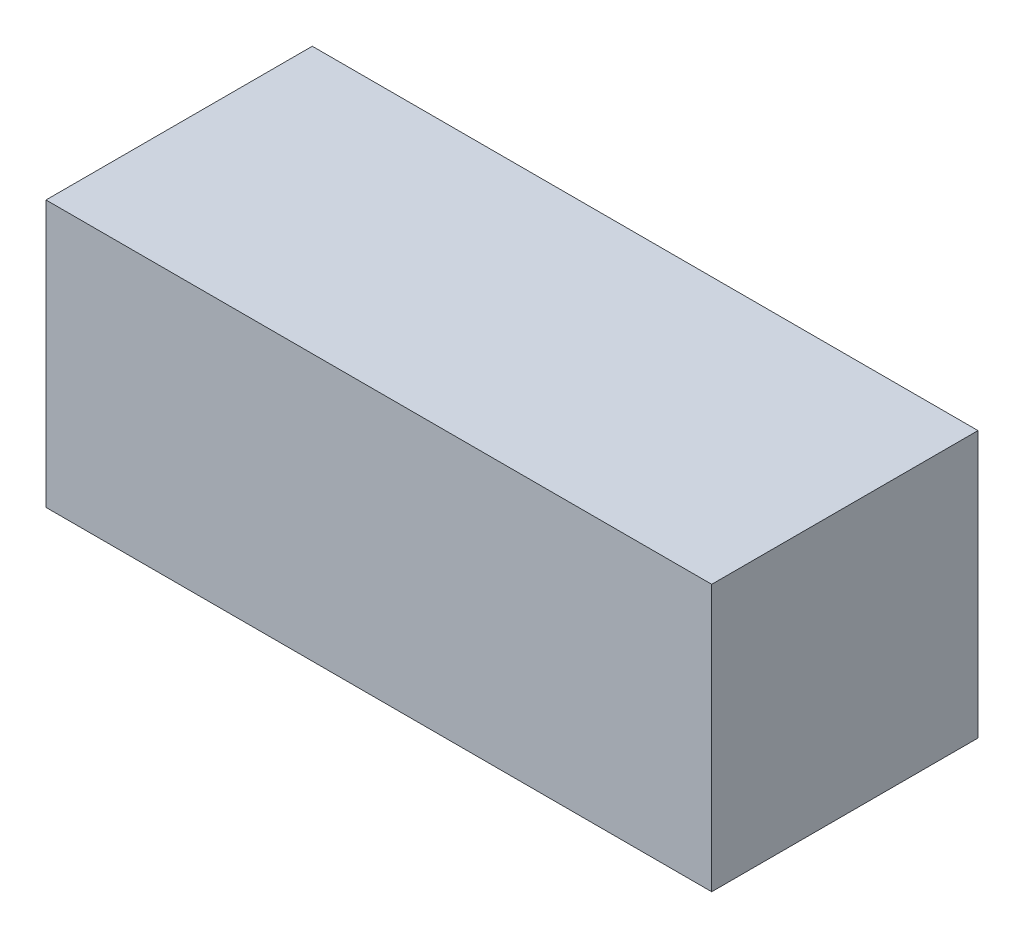
ISO-10303-21;
HEADER;
FILE_DESCRIPTION(('STEP AP214'),'2;1');
FILE_NAME('part.step','',(''),(''),'','','');
FILE_SCHEMA(('AUTOMOTIVE_DESIGN { 1 0 10303 214 1 1 1 1 }'));
ENDSEC;
DATA;
#1=APPLICATION_CONTEXT('core data for automotive mechanical design processes');
#2=APPLICATION_PROTOCOL_DEFINITION('international standard','automotive_design',2000,#1);
#3=PRODUCT_CONTEXT('',#1,'mechanical');
#4=PRODUCT('Part','Part','',(#3));
#5=PRODUCT_RELATED_PRODUCT_CATEGORY('part','',(#4));
#6=PRODUCT_DEFINITION_FORMATION('','',#4);
#7=PRODUCT_DEFINITION_CONTEXT('part definition',#1,'design');
#8=PRODUCT_DEFINITION('design','',#6,#7);
#9=PRODUCT_DEFINITION_SHAPE('','',#8);
#10=(LENGTH_UNIT() NAMED_UNIT(*) SI_UNIT(.MILLI.,.METRE.));
#11=(NAMED_UNIT(*) PLANE_ANGLE_UNIT() SI_UNIT($,.RADIAN.));
#12=(NAMED_UNIT(*) SI_UNIT($,.STERADIAN.) SOLID_ANGLE_UNIT());
#13=UNCERTAINTY_MEASURE_WITH_UNIT(LENGTH_MEASURE(1.E-05),#10,'distance_accuracy_value','');
#14=(GEOMETRIC_REPRESENTATION_CONTEXT(3) GLOBAL_UNCERTAINTY_ASSIGNED_CONTEXT((#13)) GLOBAL_UNIT_ASSIGNED_CONTEXT((#10,
#11,#12)) REPRESENTATION_CONTEXT('',''));
#15=CARTESIAN_POINT('',(0.,0.,0.));
#16=DIRECTION('',(0.,0.,1.));
#17=DIRECTION('',(1.,0.,0.));
#18=AXIS2_PLACEMENT_3D('',#15,#16,#17);
#19=CARTESIAN_POINT('',(-258.447090393941,705.,-341.76577979491));
#20=DIRECTION('',(0.,1.,0.));
#21=DIRECTION('',(0.,0.,-1.));
#22=AXIS2_PLACEMENT_3D('',#19,#20,#21);
#23=PLANE('',#22);
#24=CARTESIAN_POINT('',(-474.449169572246,705.,-382.793687092254));
#25=DIRECTION('',(0.,-1.,0.));
#26=DIRECTION('',(0.,0.,-1.));
#27=AXIS2_PLACEMENT_3D('',#24,#25,#26);
#28=CIRCLE('',#27,3.02232510648865);
#29=CARTESIAN_POINT('',(-474.449169572246,705.,-385.816012198742));
#30=VERTEX_POINT('',#29);
#31=EDGE_CURVE('E231',#30,#30,#28,.T.);
#32=ORIENTED_EDGE('',*,*,#31,.T.);
#33=EDGE_LOOP('',(#32));
#34=FACE_BOUND('',#33,.T.);
#35=CARTESIAN_POINT('',(-466.317801150332,705.,-375.92365410933));
#36=DIRECTION('',(0.,-1.,0.));
#37=DIRECTION('',(0.,0.,-1.));
#38=AXIS2_PLACEMENT_3D('',#35,#36,#37);
#39=CIRCLE('',#38,2.92635446588858);
#40=CARTESIAN_POINT('',(-466.317801150332,705.,-378.850008575219));
#41=VERTEX_POINT('',#40);
#42=EDGE_CURVE('E744',#41,#41,#39,.T.);
#43=ORIENTED_EDGE('',*,*,#42,.T.);
#44=EDGE_LOOP('',(#43));
#45=FACE_BOUND('',#44,.T.);
#46=CARTESIAN_POINT('',(-431.013382426237,705.,-332.77130718692));
#47=DIRECTION('',(0.,-1.,0.));
#48=DIRECTION('',(0.,0.,-1.));
#49=AXIS2_PLACEMENT_3D('',#46,#47,#48);
#50=CIRCLE('',#49,2.96969460121312);
#51=CARTESIAN_POINT('',(-431.013382426237,705.,-335.741001788134));
#52=VERTEX_POINT('',#51);
#53=EDGE_CURVE('E747',#52,#52,#50,.T.);
#54=ORIENTED_EDGE('',*,*,#53,.T.);
#55=EDGE_LOOP('',(#54));
#56=FACE_BOUND('',#55,.T.);
#57=CARTESIAN_POINT('',(-421.082774625095,705.,-327.80979347949));
#58=DIRECTION('',(0.,-1.,0.));
#59=DIRECTION('',(0.,0.,-1.));
#60=AXIS2_PLACEMENT_3D('',#57,#58,#59);
#61=CIRCLE('',#60,3.01217780293913);
#62=CARTESIAN_POINT('',(-421.082774625095,705.,-330.821971282429));
#63=VERTEX_POINT('',#62);
#64=EDGE_CURVE('E752',#63,#63,#61,.T.);
#65=ORIENTED_EDGE('',*,*,#64,.T.);
#66=EDGE_LOOP('',(#65));
#67=FACE_BOUND('',#66,.T.);
#68=CARTESIAN_POINT('',(-364.017672886245,705.,-296.048587357132));
#69=DIRECTION('',(0.,-1.,0.));
#70=DIRECTION('',(0.,0.,-1.));
#71=AXIS2_PLACEMENT_3D('',#68,#69,#70);
#72=CIRCLE('',#71,3.02057651298697);
#73=CARTESIAN_POINT('',(-364.017672886245,705.,-299.069163870119));
#74=VERTEX_POINT('',#73);
#75=EDGE_CURVE('E755',#74,#74,#72,.T.);
#76=ORIENTED_EDGE('',*,*,#75,.T.);
#77=EDGE_LOOP('',(#76));
#78=FACE_BOUND('',#77,.T.);
#79=CARTESIAN_POINT('',(-346.372819063942,705.,-293.429327819401));
#80=DIRECTION('',(0.,-1.,0.));
#81=DIRECTION('',(0.,0.,-1.));
#82=AXIS2_PLACEMENT_3D('',#79,#80,#81);
#83=CIRCLE('',#82,2.94464183129883);
#84=CARTESIAN_POINT('',(-346.372819063942,705.,-296.3739696507));
#85=VERTEX_POINT('',#84);
#86=EDGE_CURVE('E758',#85,#85,#83,.T.);
#87=ORIENTED_EDGE('',*,*,#86,.T.);
#88=EDGE_LOOP('',(#87));
#89=FACE_BOUND('',#88,.T.);
#90=CARTESIAN_POINT('',(-223.024834580686,705.,-263.802212935845));
#91=DIRECTION('',(0.,-1.,0.));
#92=DIRECTION('',(0.,0.,-1.));
#93=AXIS2_PLACEMENT_3D('',#90,#91,#92);
#94=CIRCLE('',#93,3.99999999999999);
#95=CARTESIAN_POINT('',(-223.024834580686,705.,-267.802212935845));
#96=VERTEX_POINT('',#95);
#97=EDGE_CURVE('E761',#96,#96,#94,.T.);
#98=ORIENTED_EDGE('',*,*,#97,.T.);
#99=EDGE_LOOP('',(#98));
#100=FACE_BOUND('',#99,.T.);
#101=CARTESIAN_POINT('',(-154.344703344319,705.,-260.643821632466));
#102=DIRECTION('',(0.,-1.,0.));
#103=DIRECTION('',(0.,0.,-1.));
#104=AXIS2_PLACEMENT_3D('',#101,#102,#103);
#105=CIRCLE('',#104,3.99999999999999);
#106=CARTESIAN_POINT('',(-154.344703344319,705.,-264.643821632466));
#107=VERTEX_POINT('',#106);
#108=EDGE_CURVE('E763',#107,#107,#105,.T.);
#109=ORIENTED_EDGE('',*,*,#108,.T.);
#110=EDGE_LOOP('',(#109));
#111=FACE_BOUND('',#110,.T.);
#112=CARTESIAN_POINT('',(-94.9095215443751,705.,-263.802212935845));
#113=DIRECTION('',(0.,-1.,0.));
#114=DIRECTION('',(0.,0.,-1.));
#115=AXIS2_PLACEMENT_3D('',#112,#113,#114);
#116=CIRCLE('',#115,4.00000000000001);
#117=CARTESIAN_POINT('',(-94.9095215443751,705.,-267.802212935845));
#118=VERTEX_POINT('',#117);
#119=EDGE_CURVE('E196',#118,#118,#116,.T.);
#120=ORIENTED_EDGE('',*,*,#119,.T.);
#121=EDGE_LOOP('',(#120));
#122=FACE_BOUND('',#121,.T.);
#123=CARTESIAN_POINT('',(-66.2029870226294,705.,-312.681641947689));
#124=CARTESIAN_POINT('',(-268.546265084858,705.,-303.965113500045));
#125=CARTESIAN_POINT('',(-436.202987022629,705.,-427.681641947689));
#126=B_SPLINE_CURVE_WITH_KNOTS('',2,(#123,#124,#125),.UNSPECIFIED.,.F.,.F.,(3,3),(0.,1.),.UNSPECIFIED.);
#127=CARTESIAN_POINT('',(-66.2029870226294,705.,-312.681641947689));
#128=VERTEX_POINT('',#127);
#129=CARTESIAN_POINT('',(-436.202987022629,705.,-427.681641947689));
#130=VERTEX_POINT('',#129);
#131=EDGE_CURVE('E190',#128,#130,#126,.T.);
#132=ORIENTED_EDGE('',*,*,#131,.T.);
#133=DIRECTION('',(0.,0.,-1.));
#134=VECTOR('',#133,1.);
#135=CARTESIAN_POINT('',(-436.202987022629,705.,-432.681641947689));
#136=LINE('',#135,#134);
#137=CARTESIAN_POINT('',(-436.202987022629,705.,-432.681641947689));
#138=VERTEX_POINT('',#137);
#139=EDGE_CURVE('E187',#130,#138,#136,.T.);
#140=ORIENTED_EDGE('',*,*,#139,.T.);
#141=DIRECTION('',(1.,0.,0.));
#142=VECTOR('',#141,1.);
#143=CARTESIAN_POINT('',(-521.202987022629,705.,-432.681641947689));
#144=LINE('',#143,#142);
#145=CARTESIAN_POINT('',(-516.202987022629,705.,-432.681641947689));
#146=VERTEX_POINT('',#145);
#147=EDGE_CURVE('E278',#146,#138,#144,.T.);
#148=ORIENTED_EDGE('',*,*,#147,.F.);
#149=DIRECTION('',(0.,0.,-1.));
#150=VECTOR('',#149,1.);
#151=CARTESIAN_POINT('',(-516.202987022629,705.,-341.76577979491));
#152=LINE('',#151,#150);
#153=CARTESIAN_POINT('',(-516.202987022629,705.,-242.681641947689));
#154=VERTEX_POINT('',#153);
#155=EDGE_CURVE('E386',#154,#146,#152,.T.);
#156=ORIENTED_EDGE('',*,*,#155,.F.);
#157=DIRECTION('',(1.,0.,0.));
#158=VECTOR('',#157,1.);
#159=CARTESIAN_POINT('',(-563.923005749217,705.,-242.681641947689));
#160=LINE('',#159,#158);
#161=CARTESIAN_POINT('',(-26.2029870226295,705.,-242.681641947689));
#162=VERTEX_POINT('',#161);
#163=EDGE_CURVE('E405',#154,#162,#160,.T.);
#164=ORIENTED_EDGE('',*,*,#163,.T.);
#165=DIRECTION('',(0.,0.,1.));
#166=VECTOR('',#165,1.);
#167=CARTESIAN_POINT('',(-26.2029870226295,705.,-237.681641947689));
#168=LINE('',#167,#166);
#169=CARTESIAN_POINT('',(-26.2029870226294,705.,-277.681641947689));
#170=VERTEX_POINT('',#169);
#171=EDGE_CURVE('E268',#170,#162,#168,.T.);
#172=ORIENTED_EDGE('',*,*,#171,.F.);
#173=CARTESIAN_POINT('',(-66.2029870226294,705.,-277.681641947689));
#174=DIRECTION('',(0.,-1.,0.));
#175=DIRECTION('',(0.,0.,-1.));
#176=AXIS2_PLACEMENT_3D('',#173,#174,#175);
#177=CIRCLE('',#176,40.);
#178=CARTESIAN_POINT('',(-66.2029870226294,705.,-317.681641947689));
#179=VERTEX_POINT('',#178);
#180=EDGE_CURVE('E265',#179,#170,#177,.T.);
#181=ORIENTED_EDGE('',*,*,#180,.F.);
#182=DIRECTION('',(0.,0.,1.));
#183=VECTOR('',#182,1.);
#184=CARTESIAN_POINT('',(-66.2029870226294,705.,-317.681641947689));
#185=LINE('',#184,#183);
#186=EDGE_CURVE('E178',#179,#128,#185,.T.);
#187=ORIENTED_EDGE('',*,*,#186,.T.);
#188=EDGE_LOOP('',(#132,#140,#148,#156,#164,#172,#181,#187));
#189=FACE_BOUND('',#188,.T.);
#190=ADVANCED_FACE('F59',(#34,#45,#56,#67,#78,#89,#100,#111,#122,#189),#23,.T.);
#191=CARTESIAN_POINT('',(-563.923005749217,0.,-242.681641947689));
#192=DIRECTION('',(0.,0.,1.));
#193=DIRECTION('',(-1.,0.,0.));
#194=AXIS2_PLACEMENT_3D('',#191,#192,#193);
#195=PLANE('',#194);
#196=DIRECTION('',(0.,1.,0.));
#197=VECTOR('',#196,1.);
#198=CARTESIAN_POINT('',(-516.202987022629,0.,-242.681641947689));
#199=LINE('',#198,#197);
#200=CARTESIAN_POINT('',(-516.202987022629,715.857864376269,-242.681641947689));
#201=VERTEX_POINT('',#200);
#202=EDGE_CURVE('E383',#154,#201,#199,.T.);
#203=ORIENTED_EDGE('',*,*,#202,.T.);
#204=DIRECTION('',(1.,0.,0.));
#205=VECTOR('',#204,1.);
#206=CARTESIAN_POINT('',(-563.923005749217,715.857864376269,-242.681641947689));
#207=LINE('',#206,#205);
#208=CARTESIAN_POINT('',(-26.2029870226295,715.857864376269,-242.681641947689));
#209=VERTEX_POINT('',#208);
#210=EDGE_CURVE('E408',#201,#209,#207,.T.);
#211=ORIENTED_EDGE('',*,*,#210,.T.);
#212=DIRECTION('',(0.,1.,0.));
#213=VECTOR('',#212,1.);
#214=CARTESIAN_POINT('',(-26.2029870226295,0.,-242.681641947689));
#215=LINE('',#214,#213);
#216=EDGE_CURVE('E399',#162,#209,#215,.T.);
#217=ORIENTED_EDGE('',*,*,#216,.F.);
#218=ORIENTED_EDGE('',*,*,#163,.F.);
#219=EDGE_LOOP('',(#203,#211,#217,#218));
#220=FACE_BOUND('',#219,.T.);
#221=ADVANCED_FACE('F428',(#220),#195,.F.);
#222=CARTESIAN_POINT('',(-563.923005749217,730.,-237.681641947689));
#223=DIRECTION('',(1.,0.,0.));
#224=DIRECTION('',(0.,0.,1.));
#225=AXIS2_PLACEMENT_3D('',#222,#223,#224);
#226=CYLINDRICAL_SURFACE('',#225,15.);
#227=DIRECTION('',(1.,0.,0.));
#228=VECTOR('',#227,1.);
#229=CARTESIAN_POINT('',(-563.923005749217,745.,-237.681641947689));
#230=LINE('',#229,#228);
#231=CARTESIAN_POINT('',(-516.202987022629,745.,-237.681641947689));
#232=VERTEX_POINT('',#231);
#233=CARTESIAN_POINT('',(-26.2029870226295,745.,-237.681641947689));
#234=VERTEX_POINT('',#233);
#235=EDGE_CURVE('E413',#232,#234,#230,.T.);
#236=ORIENTED_EDGE('',*,*,#235,.T.);
#237=CARTESIAN_POINT('',(-26.2029870226295,730.,-237.681641947689));
#238=DIRECTION('',(-1.,0.,0.));
#239=DIRECTION('',(0.,0.,1.));
#240=AXIS2_PLACEMENT_3D('',#237,#238,#239);
#241=CIRCLE('',#240,15.);
#242=EDGE_CURVE('E397',#234,#209,#241,.T.);
#243=ORIENTED_EDGE('',*,*,#242,.T.);
#244=ORIENTED_EDGE('',*,*,#210,.F.);
#245=CARTESIAN_POINT('',(-516.202987022629,730.,-237.681641947689));
#246=DIRECTION('',(1.,0.,0.));
#247=DIRECTION('',(0.,0.,-1.));
#248=AXIS2_PLACEMENT_3D('',#245,#246,#247);
#249=CIRCLE('',#248,15.);
#250=EDGE_CURVE('E381',#232,#201,#249,.F.);
#251=ORIENTED_EDGE('',*,*,#250,.F.);
#252=EDGE_LOOP('',(#236,#243,#244,#251));
#253=FACE_BOUND('',#252,.T.);
#254=ADVANCED_FACE('F421',(#253),#226,.T.);
#255=CARTESIAN_POINT('',(-26.2029870226295,705.,-237.681641947689));
#256=DIRECTION('',(0.,0.,-1.));
#257=DIRECTION('',(1.,0.,0.));
#258=AXIS2_PLACEMENT_3D('',#255,#256,#257);
#259=PLANE('',#258);
#260=DIRECTION('',(1.,0.,0.));
#261=VECTOR('',#260,1.);
#262=CARTESIAN_POINT('',(-563.923005749217,717.5,-237.681641947689));
#263=LINE('',#262,#261);
#264=CARTESIAN_POINT('',(-521.202987022629,717.5,-237.681641947689));
#265=VERTEX_POINT('',#264);
#266=CARTESIAN_POINT('',(-26.2029870226295,717.5,-237.681641947689));
#267=VERTEX_POINT('',#266);
#268=EDGE_CURVE('E393',#265,#267,#263,.T.);
#269=ORIENTED_EDGE('',*,*,#268,.F.);
#270=DIRECTION('',(0.,-1.,0.));
#271=VECTOR('',#270,1.);
#272=CARTESIAN_POINT('',(-521.202987022629,705.,-237.681641947689));
#273=LINE('',#272,#271);
#274=CARTESIAN_POINT('',(-521.202987022629,700.,-237.681641947689));
#275=VERTEX_POINT('',#274);
#276=EDGE_CURVE('E332',#265,#275,#273,.T.);
#277=ORIENTED_EDGE('',*,*,#276,.T.);
#278=DIRECTION('',(-1.,0.,0.));
#279=VECTOR('',#278,1.);
#280=CARTESIAN_POINT('',(-26.2029870226295,700.,-237.681641947689));
#281=LINE('',#280,#279);
#282=CARTESIAN_POINT('',(-26.2029870226295,700.,-237.681641947689));
#283=VERTEX_POINT('',#282);
#284=EDGE_CURVE('E348',#283,#275,#281,.T.);
#285=ORIENTED_EDGE('',*,*,#284,.F.);
#286=DIRECTION('',(0.,-1.,0.));
#287=VECTOR('',#286,1.);
#288=CARTESIAN_POINT('',(-26.2029870226295,705.,-237.681641947689));
#289=LINE('',#288,#287);
#290=EDGE_CURVE('E335',#267,#283,#289,.T.);
#291=ORIENTED_EDGE('',*,*,#290,.F.);
#292=EDGE_LOOP('',(#269,#277,#285,#291));
#293=FACE_BOUND('',#292,.T.);
#294=ADVANCED_FACE('F440',(#293),#259,.F.);
#295=CARTESIAN_POINT('',(-521.202987022629,705.,-432.681641947689));
#296=DIRECTION('',(0.,0.,1.));
#297=DIRECTION('',(-1.,0.,0.));
#298=AXIS2_PLACEMENT_3D('',#295,#296,#297);
#299=PLANE('',#298);
#300=DIRECTION('',(1.,0.,0.));
#301=VECTOR('',#300,1.);
#302=CARTESIAN_POINT('',(-521.202987022629,700.,-432.681641947689));
#303=LINE('',#302,#301);
#304=CARTESIAN_POINT('',(-521.202987022629,700.,-432.681641947689));
#305=VERTEX_POINT('',#304);
#306=CARTESIAN_POINT('',(-436.202987022629,700.,-432.681641947689));
#307=VERTEX_POINT('',#306);
#308=EDGE_CURVE('E314',#305,#307,#303,.T.);
#309=ORIENTED_EDGE('',*,*,#308,.F.);
#310=DIRECTION('',(0.,-1.,0.));
#311=VECTOR('',#310,1.);
#312=CARTESIAN_POINT('',(-521.202987022629,705.,-432.681641947689));
#313=LINE('',#312,#311);
#314=CARTESIAN_POINT('',(-521.202987022629,745.,-432.681641947689));
#315=VERTEX_POINT('',#314);
#316=EDGE_CURVE('E313',#315,#305,#313,.T.);
#317=ORIENTED_EDGE('',*,*,#316,.F.);
#318=DIRECTION('',(-1.,0.,0.));
#319=VECTOR('',#318,1.);
#320=CARTESIAN_POINT('',(-516.202987022629,745.,-432.681641947689));
#321=LINE('',#320,#319);
#322=CARTESIAN_POINT('',(-516.202987022629,745.,-432.681641947689));
#323=VERTEX_POINT('',#322);
#324=EDGE_CURVE('E376',#323,#315,#321,.T.);
#325=ORIENTED_EDGE('',*,*,#324,.F.);
#326=DIRECTION('',(0.,1.,0.));
#327=VECTOR('',#326,1.);
#328=CARTESIAN_POINT('',(-516.202987022629,745.,-432.681641947689));
#329=LINE('',#328,#327);
#330=EDGE_CURVE('E356',#146,#323,#329,.T.);
#331=ORIENTED_EDGE('',*,*,#330,.F.);
#332=ORIENTED_EDGE('',*,*,#147,.T.);
#333=DIRECTION('',(0.,-1.,0.));
#334=VECTOR('',#333,1.);
#335=CARTESIAN_POINT('',(-436.202987022629,705.,-432.681641947689));
#336=LINE('',#335,#334);
#337=EDGE_CURVE('E14',#138,#307,#336,.T.);
#338=ORIENTED_EDGE('',*,*,#337,.T.);
#339=EDGE_LOOP('',(#309,#317,#325,#331,#332,#338));
#340=FACE_BOUND('',#339,.T.);
#341=ADVANCED_FACE('F61',(#340),#299,.F.);
#342=CARTESIAN_POINT('',(-26.2029870226295,705.,-237.681641947689));
#343=DIRECTION('',(-1.,0.,0.));
#344=DIRECTION('',(0.,0.,-1.));
#345=AXIS2_PLACEMENT_3D('',#342,#343,#344);
#346=PLANE('',#345);
#347=DIRECTION('',(0.,0.,1.));
#348=VECTOR('',#347,1.);
#349=CARTESIAN_POINT('',(-26.2029870226295,700.,-237.681641947689));
#350=LINE('',#349,#348);
#351=CARTESIAN_POINT('',(-26.2029870226294,700.,-277.681641947689));
#352=VERTEX_POINT('',#351);
#353=EDGE_CURVE('E327',#352,#283,#350,.T.);
#354=ORIENTED_EDGE('',*,*,#353,.F.);
#355=DIRECTION('',(0.,-1.,0.));
#356=VECTOR('',#355,1.);
#357=CARTESIAN_POINT('',(-26.2029870226294,705.,-277.681641947689));
#358=LINE('',#357,#356);
#359=EDGE_CURVE('E273',#170,#352,#358,.T.);
#360=ORIENTED_EDGE('',*,*,#359,.F.);
#361=ORIENTED_EDGE('',*,*,#171,.T.);
#362=ORIENTED_EDGE('',*,*,#216,.T.);
#363=ORIENTED_EDGE('',*,*,#242,.F.);
#364=DIRECTION('',(0.,1.,0.));
#365=VECTOR('',#364,1.);
#366=CARTESIAN_POINT('',(-26.2029870226295,0.,-237.681641947689));
#367=LINE('',#366,#365);
#368=CARTESIAN_POINT('',(-26.2029870226295,742.5,-237.681641947689));
#369=VERTEX_POINT('',#368);
#370=EDGE_CURVE('E395',#369,#234,#367,.T.);
#371=ORIENTED_EDGE('',*,*,#370,.F.);
#372=CARTESIAN_POINT('',(-26.2029870226295,730.,-237.681641947689));
#373=DIRECTION('',(-1.,0.,0.));
#374=DIRECTION('',(0.,0.,1.));
#375=AXIS2_PLACEMENT_3D('',#372,#373,#374);
#376=CIRCLE('',#375,12.5);
#377=EDGE_CURVE('E389',#369,#267,#376,.T.);
#378=ORIENTED_EDGE('',*,*,#377,.T.);
#379=ORIENTED_EDGE('',*,*,#290,.T.);
#380=EDGE_LOOP('',(#354,#360,#361,#362,#363,#371,#378,#379));
#381=FACE_BOUND('',#380,.T.);
#382=ADVANCED_FACE('F343',(#381),#346,.F.);
#383=CARTESIAN_POINT('',(-521.202987022629,705.,-237.681641947689));
#384=DIRECTION('',(1.,0.,0.));
#385=DIRECTION('',(0.,0.,1.));
#386=AXIS2_PLACEMENT_3D('',#383,#384,#385);
#387=PLANE('',#386);
#388=ORIENTED_EDGE('',*,*,#316,.T.);
#389=DIRECTION('',(0.,0.,-1.));
#390=VECTOR('',#389,1.);
#391=CARTESIAN_POINT('',(-521.202987022629,700.,-237.681641947689));
#392=LINE('',#391,#390);
#393=EDGE_CURVE('E281',#275,#305,#392,.T.);
#394=ORIENTED_EDGE('',*,*,#393,.F.);
#395=ORIENTED_EDGE('',*,*,#276,.F.);
#396=CARTESIAN_POINT('',(-521.202987022629,730.,-237.681641947689));
#397=DIRECTION('',(-1.,0.,0.));
#398=DIRECTION('',(0.,0.,1.));
#399=AXIS2_PLACEMENT_3D('',#396,#397,#398);
#400=CIRCLE('',#399,12.5);
#401=CARTESIAN_POINT('',(-521.202987022629,742.5,-237.681641947689));
#402=VERTEX_POINT('',#401);
#403=EDGE_CURVE('E390',#265,#402,#400,.F.);
#404=ORIENTED_EDGE('',*,*,#403,.T.);
#405=DIRECTION('',(0.,-1.,0.));
#406=VECTOR('',#405,1.);
#407=CARTESIAN_POINT('',(-521.202987022629,0.,-237.681641947689));
#408=LINE('',#407,#406);
#409=CARTESIAN_POINT('',(-521.202987022629,745.,-237.681641947689));
#410=VERTEX_POINT('',#409);
#411=EDGE_CURVE('E306',#410,#402,#408,.T.);
#412=ORIENTED_EDGE('',*,*,#411,.F.);
#413=DIRECTION('',(0.,0.,1.));
#414=VECTOR('',#413,1.);
#415=CARTESIAN_POINT('',(-521.202987022629,745.,-237.681641947689));
#416=LINE('',#415,#414);
#417=EDGE_CURVE('E183',#315,#410,#416,.T.);
#418=ORIENTED_EDGE('',*,*,#417,.F.);
#419=EDGE_LOOP('',(#388,#394,#395,#404,#412,#418));
#420=FACE_BOUND('',#419,.T.);
#421=ADVANCED_FACE('F434',(#420),#387,.F.);
#422=CARTESIAN_POINT('',(-258.447090393941,700.,-341.76577979491));
#423=DIRECTION('',(0.,1.,0.));
#424=DIRECTION('',(0.,0.,-1.));
#425=AXIS2_PLACEMENT_3D('',#422,#423,#424);
#426=PLANE('',#425);
#427=CARTESIAN_POINT('',(-474.449169572246,700.,-382.793687092254));
#428=DIRECTION('',(0.,-1.,0.));
#429=DIRECTION('',(0.,0.,-1.));
#430=AXIS2_PLACEMENT_3D('',#427,#428,#429);
#431=CIRCLE('',#430,3.02232510648865);
#432=CARTESIAN_POINT('',(-474.449169572246,700.,-385.816012198742));
#433=VERTEX_POINT('',#432);
#434=EDGE_CURVE('E63',#433,#433,#431,.T.);
#435=ORIENTED_EDGE('',*,*,#434,.F.);
#436=EDGE_LOOP('',(#435));
#437=FACE_BOUND('',#436,.T.);
#438=CARTESIAN_POINT('',(-466.317801150332,700.,-375.92365410933));
#439=DIRECTION('',(0.,-1.,0.));
#440=DIRECTION('',(0.,0.,-1.));
#441=AXIS2_PLACEMENT_3D('',#438,#439,#440);
#442=CIRCLE('',#441,2.92635446588858);
#443=CARTESIAN_POINT('',(-466.317801150332,700.,-378.850008575219));
#444=VERTEX_POINT('',#443);
#445=EDGE_CURVE('E248',#444,#444,#442,.T.);
#446=ORIENTED_EDGE('',*,*,#445,.F.);
#447=EDGE_LOOP('',(#446));
#448=FACE_BOUND('',#447,.T.);
#449=CARTESIAN_POINT('',(-431.013382426237,700.,-332.77130718692));
#450=DIRECTION('',(0.,-1.,0.));
#451=DIRECTION('',(0.,0.,-1.));
#452=AXIS2_PLACEMENT_3D('',#449,#450,#451);
#453=CIRCLE('',#452,2.96969460121312);
#454=CARTESIAN_POINT('',(-431.013382426237,700.,-335.741001788134));
#455=VERTEX_POINT('',#454);
#456=EDGE_CURVE('E246',#455,#455,#453,.T.);
#457=ORIENTED_EDGE('',*,*,#456,.F.);
#458=EDGE_LOOP('',(#457));
#459=FACE_BOUND('',#458,.T.);
#460=CARTESIAN_POINT('',(-421.082774625095,700.,-327.80979347949));
#461=DIRECTION('',(0.,-1.,0.));
#462=DIRECTION('',(0.,0.,-1.));
#463=AXIS2_PLACEMENT_3D('',#460,#461,#462);
#464=CIRCLE('',#463,3.01217780293913);
#465=CARTESIAN_POINT('',(-421.082774625095,700.,-330.821971282429));
#466=VERTEX_POINT('',#465);
#467=EDGE_CURVE('E243',#466,#466,#464,.T.);
#468=ORIENTED_EDGE('',*,*,#467,.F.);
#469=EDGE_LOOP('',(#468));
#470=FACE_BOUND('',#469,.T.);
#471=CARTESIAN_POINT('',(-364.017672886245,700.,-296.048587357132));
#472=DIRECTION('',(0.,-1.,0.));
#473=DIRECTION('',(0.,0.,-1.));
#474=AXIS2_PLACEMENT_3D('',#471,#472,#473);
#475=CIRCLE('',#474,3.02057651298697);
#476=CARTESIAN_POINT('',(-364.017672886245,700.,-299.069163870119));
#477=VERTEX_POINT('',#476);
#478=EDGE_CURVE('E240',#477,#477,#475,.T.);
#479=ORIENTED_EDGE('',*,*,#478,.F.);
#480=EDGE_LOOP('',(#479));
#481=FACE_BOUND('',#480,.T.);
#482=CARTESIAN_POINT('',(-346.372819063942,700.,-293.429327819401));
#483=DIRECTION('',(0.,-1.,0.));
#484=DIRECTION('',(0.,0.,-1.));
#485=AXIS2_PLACEMENT_3D('',#482,#483,#484);
#486=CIRCLE('',#485,2.94464183129883);
#487=CARTESIAN_POINT('',(-346.372819063942,700.,-296.3739696507));
#488=VERTEX_POINT('',#487);
#489=EDGE_CURVE('E237',#488,#488,#486,.T.);
#490=ORIENTED_EDGE('',*,*,#489,.F.);
#491=EDGE_LOOP('',(#490));
#492=FACE_BOUND('',#491,.T.);
#493=CARTESIAN_POINT('',(-223.024834580686,700.,-263.802212935845));
#494=DIRECTION('',(0.,-1.,0.));
#495=DIRECTION('',(0.,0.,-1.));
#496=AXIS2_PLACEMENT_3D('',#493,#494,#495);
#497=CIRCLE('',#496,3.99999999999999);
#498=CARTESIAN_POINT('',(-223.024834580686,700.,-267.802212935845));
#499=VERTEX_POINT('',#498);
#500=EDGE_CURVE('E234',#499,#499,#497,.T.);
#501=ORIENTED_EDGE('',*,*,#500,.F.);
#502=EDGE_LOOP('',(#501));
#503=FACE_BOUND('',#502,.T.);
#504=CARTESIAN_POINT('',(-154.344703344319,700.,-260.643821632466));
#505=DIRECTION('',(0.,-1.,0.));
#506=DIRECTION('',(0.,0.,-1.));
#507=AXIS2_PLACEMENT_3D('',#504,#505,#506);
#508=CIRCLE('',#507,3.99999999999999);
#509=CARTESIAN_POINT('',(-154.344703344319,700.,-264.643821632466));
#510=VERTEX_POINT('',#509);
#511=EDGE_CURVE('E230',#510,#510,#508,.T.);
#512=ORIENTED_EDGE('',*,*,#511,.F.);
#513=EDGE_LOOP('',(#512));
#514=FACE_BOUND('',#513,.T.);
#515=CARTESIAN_POINT('',(-94.9095215443751,700.,-263.802212935845));
#516=DIRECTION('',(0.,-1.,0.));
#517=DIRECTION('',(0.,0.,-1.));
#518=AXIS2_PLACEMENT_3D('',#515,#516,#517);
#519=CIRCLE('',#518,4.00000000000001);
#520=CARTESIAN_POINT('',(-94.9095215443751,700.,-267.802212935845));
#521=VERTEX_POINT('',#520);
#522=EDGE_CURVE('E227',#521,#521,#519,.T.);
#523=ORIENTED_EDGE('',*,*,#522,.F.);
#524=EDGE_LOOP('',(#523));
#525=FACE_BOUND('',#524,.T.);
#526=ORIENTED_EDGE('',*,*,#393,.T.);
#527=ORIENTED_EDGE('',*,*,#308,.T.);
#528=CARTESIAN_POINT('',(-436.202987022629,700.,-432.681641947689));
#529=CARTESIAN_POINT('',(-265.691193765253,700.,-308.349917642132));
#530=CARTESIAN_POINT('',(-66.2029870226294,700.,-317.681641947689));
#531=B_SPLINE_CURVE_WITH_KNOTS('',2,(#528,#529,#530),.UNSPECIFIED.,.F.,.F.,(3,3),(0.,1.),.UNSPECIFIED.);
#532=CARTESIAN_POINT('',(-66.2029870226294,700.,-317.681641947689));
#533=VERTEX_POINT('',#532);
#534=EDGE_CURVE('E317',#307,#533,#531,.T.);
#535=ORIENTED_EDGE('',*,*,#534,.T.);
#536=CARTESIAN_POINT('',(-66.2029870226294,700.,-277.681641947689));
#537=DIRECTION('',(0.,-1.,0.));
#538=DIRECTION('',(0.,0.,-1.));
#539=AXIS2_PLACEMENT_3D('',#536,#537,#538);
#540=CIRCLE('',#539,40.);
#541=EDGE_CURVE('E322',#533,#352,#540,.T.);
#542=ORIENTED_EDGE('',*,*,#541,.T.);
#543=ORIENTED_EDGE('',*,*,#353,.T.);
#544=ORIENTED_EDGE('',*,*,#284,.T.);
#545=EDGE_LOOP('',(#526,#527,#535,#542,#543,#544));
#546=FACE_BOUND('',#545,.T.);
#547=ADVANCED_FACE('F298',(#437,#448,#459,#470,#481,#492,#503,#514,#525,#546),#426,.F.);
#548=CARTESIAN_POINT('',(-436.202987022629,705.,-432.681641947689));
#549=CARTESIAN_POINT('',(-265.691193765253,705.,-308.349917642132));
#550=CARTESIAN_POINT('',(-66.2029870226294,705.,-317.681641947689));
#551=B_SPLINE_CURVE_WITH_KNOTS('',2,(#548,#549,#550),.UNSPECIFIED.,.F.,.F.,(3,3),(0.,1.),.UNSPECIFIED.);
#552=DIRECTION('',(0.,-1.,0.));
#553=VECTOR('',#552,1.);
#554=SURFACE_OF_LINEAR_EXTRUSION('',#551,#553);
#555=ORIENTED_EDGE('',*,*,#534,.F.);
#556=ORIENTED_EDGE('',*,*,#337,.F.);
#557=CARTESIAN_POINT('',(-436.202987022629,705.,-432.681641947689));
#558=CARTESIAN_POINT('',(-265.691193765253,705.,-308.349917642132));
#559=CARTESIAN_POINT('',(-66.2029870226294,705.,-317.681641947689));
#560=B_SPLINE_CURVE_WITH_KNOTS('',2,(#557,#558,#559),.UNSPECIFIED.,.F.,.F.,(3,3),(0.,1.),.UNSPECIFIED.);
#561=EDGE_CURVE('E269',#138,#179,#560,.T.);
#562=ORIENTED_EDGE('',*,*,#561,.T.);
#563=DIRECTION('',(0.,-1.,0.));
#564=VECTOR('',#563,1.);
#565=CARTESIAN_POINT('',(-66.2029870226294,705.,-317.681641947689));
#566=LINE('',#565,#564);
#567=EDGE_CURVE('E68',#179,#533,#566,.T.);
#568=ORIENTED_EDGE('',*,*,#567,.T.);
#569=EDGE_LOOP('',(#555,#556,#562,#568));
#570=FACE_BOUND('',#569,.T.);
#571=ADVANCED_FACE('F287',(#570),#554,.T.);
#572=CARTESIAN_POINT('',(-66.2029870226294,705.,-277.681641947689));
#573=DIRECTION('',(0.,-1.,0.));
#574=DIRECTION('',(0.,0.,1.));
#575=AXIS2_PLACEMENT_3D('',#572,#573,#574);
#576=CYLINDRICAL_SURFACE('',#575,40.);
#577=ORIENTED_EDGE('',*,*,#541,.F.);
#578=ORIENTED_EDGE('',*,*,#567,.F.);
#579=ORIENTED_EDGE('',*,*,#180,.T.);
#580=ORIENTED_EDGE('',*,*,#359,.T.);
#581=EDGE_LOOP('',(#577,#578,#579,#580));
#582=FACE_BOUND('',#581,.T.);
#583=ADVANCED_FACE('F297',(#582),#576,.T.);
#584=CARTESIAN_POINT('',(-563.923005749217,730.,-237.681641947689));
#585=DIRECTION('',(1.,0.,0.));
#586=DIRECTION('',(0.,0.,1.));
#587=AXIS2_PLACEMENT_3D('',#584,#585,#586);
#588=CYLINDRICAL_SURFACE('',#587,12.5);
#589=DIRECTION('',(1.,0.,0.));
#590=VECTOR('',#589,1.);
#591=CARTESIAN_POINT('',(-563.923005749217,742.5,-237.681641947689));
#592=LINE('',#591,#590);
#593=EDGE_CURVE('E402',#402,#369,#592,.T.);
#594=ORIENTED_EDGE('',*,*,#593,.F.);
#595=ORIENTED_EDGE('',*,*,#403,.F.);
#596=ORIENTED_EDGE('',*,*,#268,.T.);
#597=ORIENTED_EDGE('',*,*,#377,.F.);
#598=EDGE_LOOP('',(#594,#595,#596,#597));
#599=FACE_BOUND('',#598,.T.);
#600=ADVANCED_FACE('F438',(#599),#588,.F.);
#601=CARTESIAN_POINT('',(-563.923005749217,0.,-237.681641947689));
#602=DIRECTION('',(0.,0.,1.));
#603=DIRECTION('',(-1.,0.,0.));
#604=AXIS2_PLACEMENT_3D('',#601,#602,#603);
#605=PLANE('',#604);
#606=EDGE_CURVE('E411',#410,#232,#230,.T.);
#607=ORIENTED_EDGE('',*,*,#606,.F.);
#608=ORIENTED_EDGE('',*,*,#411,.T.);
#609=ORIENTED_EDGE('',*,*,#593,.T.);
#610=ORIENTED_EDGE('',*,*,#370,.T.);
#611=ORIENTED_EDGE('',*,*,#235,.F.);
#612=EDGE_LOOP('',(#607,#608,#609,#610,#611));
#613=FACE_BOUND('',#612,.T.);
#614=ADVANCED_FACE('F424',(#613),#605,.T.);
#615=CARTESIAN_POINT('',(-516.202987022629,745.,-237.681641947689));
#616=DIRECTION('',(0.,1.,0.));
#617=DIRECTION('',(0.,0.,-1.));
#618=AXIS2_PLACEMENT_3D('',#615,#616,#617);
#619=PLANE('',#618);
#620=ORIENTED_EDGE('',*,*,#417,.T.);
#621=ORIENTED_EDGE('',*,*,#606,.T.);
#622=DIRECTION('',(0.,0.,1.));
#623=VECTOR('',#622,1.);
#624=CARTESIAN_POINT('',(-516.202987022629,745.,-237.681641947689));
#625=LINE('',#624,#623);
#626=EDGE_CURVE('E374',#323,#232,#625,.T.);
#627=ORIENTED_EDGE('',*,*,#626,.F.);
#628=ORIENTED_EDGE('',*,*,#324,.T.);
#629=EDGE_LOOP('',(#620,#621,#627,#628));
#630=FACE_BOUND('',#629,.T.);
#631=ADVANCED_FACE('F431',(#630),#619,.T.);
#632=CARTESIAN_POINT('',(-516.202987022629,730.,-237.681641947689));
#633=DIRECTION('',(-1.,0.,0.));
#634=DIRECTION('',(0.,0.,-1.));
#635=AXIS2_PLACEMENT_3D('',#632,#633,#634);
#636=PLANE('',#635);
#637=ORIENTED_EDGE('',*,*,#155,.T.);
#638=ORIENTED_EDGE('',*,*,#330,.T.);
#639=ORIENTED_EDGE('',*,*,#626,.T.);
#640=ORIENTED_EDGE('',*,*,#250,.T.);
#641=ORIENTED_EDGE('',*,*,#202,.F.);
#642=EDGE_LOOP('',(#637,#638,#639,#640,#641));
#643=FACE_BOUND('',#642,.T.);
#644=ADVANCED_FACE('F207',(#643),#636,.F.);
#645=CARTESIAN_POINT('',(179399.129928414,745.,-984620.675822956));
#646=CARTESIAN_POINT('',(-212077.093758222,745.,976969.386915229));
#647=CARTESIAN_POINT('',(243907.016921864,745.,-970636.245329769));
#648=B_SPLINE_CURVE_WITH_KNOTS('',2,(#645,#646,#647),.UNSPECIFIED.,.F.,.F.,(3,3),(0.,1.),.UNSPECIFIED.);
#649=DIRECTION('',(0.,-1.,0.));
#650=VECTOR('',#649,1.);
#651=SURFACE_OF_LINEAR_EXTRUSION('',#648,#650);
#652=ORIENTED_EDGE('',*,*,#561,.F.);
#653=DIRECTION('',(0.,-1.,0.));
#654=VECTOR('',#653,1.);
#655=CARTESIAN_POINT('',(-436.202987022629,745.,-432.681641947689));
#656=LINE('',#655,#654);
#657=CARTESIAN_POINT('',(-436.202987022629,745.,-432.681641947689));
#658=VERTEX_POINT('',#657);
#659=EDGE_CURVE('E186',#658,#138,#656,.T.);
#660=ORIENTED_EDGE('',*,*,#659,.F.);
#661=CARTESIAN_POINT('',(-66.2029870226294,745.,-317.681641947689));
#662=VERTEX_POINT('',#661);
#663=EDGE_CURVE('E172',#658,#662,#648,.T.);
#664=ORIENTED_EDGE('',*,*,#663,.T.);
#665=DIRECTION('',(0.,-1.,0.));
#666=VECTOR('',#665,1.);
#667=CARTESIAN_POINT('',(-66.2029870226294,745.,-317.681641947689));
#668=LINE('',#667,#666);
#669=EDGE_CURVE('E176',#662,#179,#668,.T.);
#670=ORIENTED_EDGE('',*,*,#669,.T.);
#671=EDGE_LOOP('',(#652,#660,#664,#670));
#672=FACE_BOUND('',#671,.T.);
#673=ADVANCED_FACE('F185',(#672),#651,.T.);
#674=CARTESIAN_POINT('',(-66.2029870226294,745.,-317.681641947689));
#675=DIRECTION('',(-1.,0.,0.));
#676=DIRECTION('',(0.,0.,-1.));
#677=AXIS2_PLACEMENT_3D('',#674,#675,#676);
#678=PLANE('',#677);
#679=ORIENTED_EDGE('',*,*,#186,.F.);
#680=ORIENTED_EDGE('',*,*,#669,.F.);
#681=DIRECTION('',(0.,0.,1.));
#682=VECTOR('',#681,1.);
#683=CARTESIAN_POINT('',(-66.2029870226294,745.,-317.681641947689));
#684=LINE('',#683,#682);
#685=CARTESIAN_POINT('',(-66.2029870226294,745.,-312.681641947689));
#686=VERTEX_POINT('',#685);
#687=EDGE_CURVE('E168',#662,#686,#684,.T.);
#688=ORIENTED_EDGE('',*,*,#687,.T.);
#689=DIRECTION('',(0.,-1.,0.));
#690=VECTOR('',#689,1.);
#691=CARTESIAN_POINT('',(-66.2029870226294,745.,-312.681641947689));
#692=LINE('',#691,#690);
#693=EDGE_CURVE('E76',#686,#128,#692,.T.);
#694=ORIENTED_EDGE('',*,*,#693,.T.);
#695=EDGE_LOOP('',(#679,#680,#688,#694));
#696=FACE_BOUND('',#695,.T.);
#697=ADVANCED_FACE('F177',(#696),#678,.F.);
#698=CARTESIAN_POINT('',(-66.2029870226294,745.,-312.681641947689));
#699=CARTESIAN_POINT('',(-268.546265084858,745.,-303.965113500045));
#700=CARTESIAN_POINT('',(-436.202987022629,745.,-427.681641947689));
#701=B_SPLINE_CURVE_WITH_KNOTS('',2,(#698,#699,#700),.UNSPECIFIED.,.F.,.F.,(3,3),(0.,1.),.UNSPECIFIED.);
#702=DIRECTION('',(0.,-1.,0.));
#703=VECTOR('',#702,1.);
#704=SURFACE_OF_LINEAR_EXTRUSION('',#701,#703);
#705=ORIENTED_EDGE('',*,*,#131,.F.);
#706=ORIENTED_EDGE('',*,*,#693,.F.);
#707=CARTESIAN_POINT('',(-436.202987022629,745.,-427.681641947689));
#708=VERTEX_POINT('',#707);
#709=EDGE_CURVE('E174',#686,#708,#701,.T.);
#710=ORIENTED_EDGE('',*,*,#709,.T.);
#711=DIRECTION('',(0.,-1.,0.));
#712=VECTOR('',#711,1.);
#713=CARTESIAN_POINT('',(-436.202987022629,745.,-427.681641947689));
#714=LINE('',#713,#712);
#715=EDGE_CURVE('E84',#708,#130,#714,.T.);
#716=ORIENTED_EDGE('',*,*,#715,.T.);
#717=EDGE_LOOP('',(#705,#706,#710,#716));
#718=FACE_BOUND('',#717,.T.);
#719=ADVANCED_FACE('F620',(#718),#704,.T.);
#720=CARTESIAN_POINT('',(-436.202987022629,745.,-432.681641947689));
#721=DIRECTION('',(1.,0.,0.));
#722=DIRECTION('',(0.,0.,1.));
#723=AXIS2_PLACEMENT_3D('',#720,#721,#722);
#724=PLANE('',#723);
#725=ORIENTED_EDGE('',*,*,#139,.F.);
#726=ORIENTED_EDGE('',*,*,#715,.F.);
#727=DIRECTION('',(0.,0.,-1.));
#728=VECTOR('',#727,1.);
#729=CARTESIAN_POINT('',(-436.202987022629,745.,-432.681641947689));
#730=LINE('',#729,#728);
#731=EDGE_CURVE('E224',#708,#658,#730,.T.);
#732=ORIENTED_EDGE('',*,*,#731,.T.);
#733=ORIENTED_EDGE('',*,*,#659,.T.);
#734=EDGE_LOOP('',(#725,#726,#732,#733));
#735=FACE_BOUND('',#734,.T.);
#736=ADVANCED_FACE('F360',(#735),#724,.F.);
#737=CARTESIAN_POINT('',(-212.01016654156,745.,-329.536830566497));
#738=DIRECTION('',(0.,1.,0.));
#739=DIRECTION('',(0.,0.,-1.));
#740=AXIS2_PLACEMENT_3D('',#737,#738,#739);
#741=PLANE('',#740);
#742=ORIENTED_EDGE('',*,*,#663,.F.);
#743=ORIENTED_EDGE('',*,*,#731,.F.);
#744=ORIENTED_EDGE('',*,*,#709,.F.);
#745=ORIENTED_EDGE('',*,*,#687,.F.);
#746=EDGE_LOOP('',(#742,#743,#744,#745));
#747=FACE_BOUND('',#746,.T.);
#748=ADVANCED_FACE('F170',(#747),#741,.T.);
#749=CARTESIAN_POINT('',(-94.9095215443751,685.,-263.802212935845));
#750=DIRECTION('',(0.,1.,0.));
#751=DIRECTION('',(0.,0.,-1.));
#752=AXIS2_PLACEMENT_3D('',#749,#750,#751);
#753=CYLINDRICAL_SURFACE('',#752,4.00000000000001);
#754=ORIENTED_EDGE('',*,*,#119,.F.);
#755=EDGE_LOOP('',(#754));
#756=FACE_BOUND('',#755,.T.);
#757=ORIENTED_EDGE('',*,*,#522,.T.);
#758=EDGE_LOOP('',(#757));
#759=FACE_BOUND('',#758,.T.);
#760=ADVANCED_FACE('F640',(#756,#759),#753,.F.);
#761=CARTESIAN_POINT('',(-154.344703344319,685.,-260.643821632466));
#762=DIRECTION('',(0.,1.,0.));
#763=DIRECTION('',(0.,0.,-1.));
#764=AXIS2_PLACEMENT_3D('',#761,#762,#763);
#765=CYLINDRICAL_SURFACE('',#764,3.99999999999999);
#766=ORIENTED_EDGE('',*,*,#108,.F.);
#767=EDGE_LOOP('',(#766));
#768=FACE_BOUND('',#767,.T.);
#769=ORIENTED_EDGE('',*,*,#511,.T.);
#770=EDGE_LOOP('',(#769));
#771=FACE_BOUND('',#770,.T.);
#772=ADVANCED_FACE('F648',(#768,#771),#765,.F.);
#773=CARTESIAN_POINT('',(-223.024834580686,685.,-263.802212935845));
#774=DIRECTION('',(0.,1.,0.));
#775=DIRECTION('',(0.,0.,-1.));
#776=AXIS2_PLACEMENT_3D('',#773,#774,#775);
#777=CYLINDRICAL_SURFACE('',#776,3.99999999999999);
#778=ORIENTED_EDGE('',*,*,#97,.F.);
#779=EDGE_LOOP('',(#778));
#780=FACE_BOUND('',#779,.T.);
#781=ORIENTED_EDGE('',*,*,#500,.T.);
#782=EDGE_LOOP('',(#781));
#783=FACE_BOUND('',#782,.T.);
#784=ADVANCED_FACE('F657',(#780,#783),#777,.F.);
#785=CARTESIAN_POINT('',(-346.372819063942,685.,-293.429327819401));
#786=DIRECTION('',(0.,1.,0.));
#787=DIRECTION('',(0.,0.,-1.));
#788=AXIS2_PLACEMENT_3D('',#785,#786,#787);
#789=CYLINDRICAL_SURFACE('',#788,2.94464183129883);
#790=ORIENTED_EDGE('',*,*,#86,.F.);
#791=EDGE_LOOP('',(#790));
#792=FACE_BOUND('',#791,.T.);
#793=ORIENTED_EDGE('',*,*,#489,.T.);
#794=EDGE_LOOP('',(#793));
#795=FACE_BOUND('',#794,.T.);
#796=ADVANCED_FACE('F666',(#792,#795),#789,.F.);
#797=CARTESIAN_POINT('',(-364.017672886245,685.,-296.048587357132));
#798=DIRECTION('',(0.,1.,0.));
#799=DIRECTION('',(0.,0.,-1.));
#800=AXIS2_PLACEMENT_3D('',#797,#798,#799);
#801=CYLINDRICAL_SURFACE('',#800,3.02057651298697);
#802=ORIENTED_EDGE('',*,*,#75,.F.);
#803=EDGE_LOOP('',(#802));
#804=FACE_BOUND('',#803,.T.);
#805=ORIENTED_EDGE('',*,*,#478,.T.);
#806=EDGE_LOOP('',(#805));
#807=FACE_BOUND('',#806,.T.);
#808=ADVANCED_FACE('F675',(#804,#807),#801,.F.);
#809=CARTESIAN_POINT('',(-421.082774625095,685.,-327.80979347949));
#810=DIRECTION('',(0.,1.,0.));
#811=DIRECTION('',(0.,0.,-1.));
#812=AXIS2_PLACEMENT_3D('',#809,#810,#811);
#813=CYLINDRICAL_SURFACE('',#812,3.01217780293913);
#814=ORIENTED_EDGE('',*,*,#64,.F.);
#815=EDGE_LOOP('',(#814));
#816=FACE_BOUND('',#815,.T.);
#817=ORIENTED_EDGE('',*,*,#467,.T.);
#818=EDGE_LOOP('',(#817));
#819=FACE_BOUND('',#818,.T.);
#820=ADVANCED_FACE('F684',(#816,#819),#813,.F.);
#821=CARTESIAN_POINT('',(-431.013382426237,685.,-332.77130718692));
#822=DIRECTION('',(0.,1.,0.));
#823=DIRECTION('',(0.,0.,-1.));
#824=AXIS2_PLACEMENT_3D('',#821,#822,#823);
#825=CYLINDRICAL_SURFACE('',#824,2.96969460121312);
#826=ORIENTED_EDGE('',*,*,#53,.F.);
#827=EDGE_LOOP('',(#826));
#828=FACE_BOUND('',#827,.T.);
#829=ORIENTED_EDGE('',*,*,#456,.T.);
#830=EDGE_LOOP('',(#829));
#831=FACE_BOUND('',#830,.T.);
#832=ADVANCED_FACE('F693',(#828,#831),#825,.F.);
#833=CARTESIAN_POINT('',(-466.317801150332,685.,-375.92365410933));
#834=DIRECTION('',(0.,1.,0.));
#835=DIRECTION('',(0.,0.,-1.));
#836=AXIS2_PLACEMENT_3D('',#833,#834,#835);
#837=CYLINDRICAL_SURFACE('',#836,2.92635446588858);
#838=ORIENTED_EDGE('',*,*,#42,.F.);
#839=EDGE_LOOP('',(#838));
#840=FACE_BOUND('',#839,.T.);
#841=ORIENTED_EDGE('',*,*,#445,.T.);
#842=EDGE_LOOP('',(#841));
#843=FACE_BOUND('',#842,.T.);
#844=ADVANCED_FACE('F702',(#840,#843),#837,.F.);
#845=CARTESIAN_POINT('',(-474.449169572246,685.,-382.793687092254));
#846=DIRECTION('',(0.,1.,0.));
#847=DIRECTION('',(0.,0.,-1.));
#848=AXIS2_PLACEMENT_3D('',#845,#846,#847);
#849=CYLINDRICAL_SURFACE('',#848,3.02232510648865);
#850=ORIENTED_EDGE('',*,*,#31,.F.);
#851=EDGE_LOOP('',(#850));
#852=FACE_BOUND('',#851,.T.);
#853=ORIENTED_EDGE('',*,*,#434,.T.);
#854=EDGE_LOOP('',(#853));
#855=FACE_BOUND('',#854,.T.);
#856=ADVANCED_FACE('F711',(#852,#855),#849,.F.);
#857=CLOSED_SHELL('',(#190,#221,#254,#294,#341,#382,#421,#547,#571,#583,#600,#614,#631,#644,
#673,#697,#719,#736,#748,#760,#772,#784,#796,#808,#820,#832,#844,#856));
#858=MANIFOLD_SOLID_BREP('B2',#857);
#859=CARTESIAN_POINT('',(503.178608832802,2000.,-197.681641947689));
#860=DIRECTION('',(-1.,0.,0.));
#861=DIRECTION('',(0.,0.,-1.));
#862=AXIS2_PLACEMENT_3D('',#859,#860,#861);
#863=PLANE('',#862);
#864=DIRECTION('',(0.,0.,1.));
#865=VECTOR('',#864,1.);
#866=CARTESIAN_POINT('',(503.178608832802,0.,-197.681641947689));
#867=LINE('',#866,#865);
#868=CARTESIAN_POINT('',(503.178608832802,0.,-2197.68164194769));
#869=VERTEX_POINT('',#868);
#870=CARTESIAN_POINT('',(503.178608832802,0.,-197.681641947689));
#871=VERTEX_POINT('',#870);
#872=EDGE_CURVE('E872',#869,#871,#867,.T.);
#873=ORIENTED_EDGE('',*,*,#872,.F.);
#874=DIRECTION('',(0.,-1.,0.));
#875=VECTOR('',#874,1.);
#876=CARTESIAN_POINT('',(503.178608832802,2000.,-2197.68164194769));
#877=LINE('',#876,#875);
#878=CARTESIAN_POINT('',(503.178608832802,2000.,-2197.68164194769));
#879=VERTEX_POINT('',#878);
#880=EDGE_CURVE('E871',#879,#869,#877,.T.);
#881=ORIENTED_EDGE('',*,*,#880,.F.);
#882=DIRECTION('',(0.,0.,1.));
#883=VECTOR('',#882,1.);
#884=CARTESIAN_POINT('',(503.178608832802,2000.,-197.681641947689));
#885=LINE('',#884,#883);
#886=CARTESIAN_POINT('',(503.178608832802,2000.,-197.681641947689));
#887=VERTEX_POINT('',#886);
#888=EDGE_CURVE('E866',#879,#887,#885,.T.);
#889=ORIENTED_EDGE('',*,*,#888,.T.);
#890=DIRECTION('',(0.,-1.,0.));
#891=VECTOR('',#890,1.);
#892=CARTESIAN_POINT('',(503.178608832802,2000.,-197.681641947689));
#893=LINE('',#892,#891);
#894=EDGE_CURVE('E57',#887,#871,#893,.T.);
#895=ORIENTED_EDGE('',*,*,#894,.T.);
#896=EDGE_LOOP('',(#873,#881,#889,#895));
#897=FACE_BOUND('',#896,.T.);
#898=ADVANCED_FACE('F809',(#897),#863,.F.);
#899=CARTESIAN_POINT('',(503.178608832802,2000.,-197.681641947689));
#900=DIRECTION('',(0.,0.,-1.));
#901=DIRECTION('',(1.,0.,0.));
#902=AXIS2_PLACEMENT_3D('',#899,#900,#901);
#903=PLANE('',#902);
#904=DIRECTION('',(-1.,0.,0.));
#905=VECTOR('',#904,1.);
#906=CARTESIAN_POINT('',(503.178608832802,0.,-197.681641947689));
#907=LINE('',#906,#905);
#908=CARTESIAN_POINT('',(-4496.8213911672,0.,-197.681641947689));
#909=VERTEX_POINT('',#908);
#910=EDGE_CURVE('E874',#871,#909,#907,.T.);
#911=ORIENTED_EDGE('',*,*,#910,.F.);
#912=ORIENTED_EDGE('',*,*,#894,.F.);
#913=DIRECTION('',(-1.,0.,0.));
#914=VECTOR('',#913,1.);
#915=CARTESIAN_POINT('',(503.178608832802,2000.,-197.681641947689));
#916=LINE('',#915,#914);
#917=CARTESIAN_POINT('',(-4496.8213911672,2000.,-197.681641947689));
#918=VERTEX_POINT('',#917);
#919=EDGE_CURVE('E850',#887,#918,#916,.T.);
#920=ORIENTED_EDGE('',*,*,#919,.T.);
#921=DIRECTION('',(0.,-1.,0.));
#922=VECTOR('',#921,1.);
#923=CARTESIAN_POINT('',(-4496.8213911672,2000.,-197.681641947689));
#924=LINE('',#923,#922);
#925=EDGE_CURVE('E817',#918,#909,#924,.T.);
#926=ORIENTED_EDGE('',*,*,#925,.T.);
#927=EDGE_LOOP('',(#911,#912,#920,#926));
#928=FACE_BOUND('',#927,.T.);
#929=ADVANCED_FACE('F864',(#928),#903,.F.);
#930=CARTESIAN_POINT('',(-4496.8213911672,2000.,-197.681641947689));
#931=DIRECTION('',(1.,0.,0.));
#932=DIRECTION('',(0.,0.,1.));
#933=AXIS2_PLACEMENT_3D('',#930,#931,#932);
#934=PLANE('',#933);
#935=DIRECTION('',(0.,0.,-1.));
#936=VECTOR('',#935,1.);
#937=CARTESIAN_POINT('',(-4496.8213911672,0.,-197.681641947689));
#938=LINE('',#937,#936);
#939=CARTESIAN_POINT('',(-4496.8213911672,0.,-2197.68164194769));
#940=VERTEX_POINT('',#939);
#941=EDGE_CURVE('E860',#909,#940,#938,.T.);
#942=ORIENTED_EDGE('',*,*,#941,.F.);
#943=ORIENTED_EDGE('',*,*,#925,.F.);
#944=DIRECTION('',(0.,0.,-1.));
#945=VECTOR('',#944,1.);
#946=CARTESIAN_POINT('',(-4496.8213911672,2000.,-197.681641947689));
#947=LINE('',#946,#945);
#948=CARTESIAN_POINT('',(-4496.8213911672,2000.,-2197.68164194769));
#949=VERTEX_POINT('',#948);
#950=EDGE_CURVE('E853',#918,#949,#947,.T.);
#951=ORIENTED_EDGE('',*,*,#950,.T.);
#952=DIRECTION('',(0.,-1.,0.));
#953=VECTOR('',#952,1.);
#954=CARTESIAN_POINT('',(-4496.8213911672,2000.,-2197.68164194769));
#955=LINE('',#954,#953);
#956=EDGE_CURVE('E863',#949,#940,#955,.T.);
#957=ORIENTED_EDGE('',*,*,#956,.T.);
#958=EDGE_LOOP('',(#942,#943,#951,#957));
#959=FACE_BOUND('',#958,.T.);
#960=ADVANCED_FACE('F859',(#959),#934,.F.);
#961=CARTESIAN_POINT('',(503.178608832802,2000.,-2197.68164194769));
#962=DIRECTION('',(0.,0.,1.));
#963=DIRECTION('',(-1.,0.,0.));
#964=AXIS2_PLACEMENT_3D('',#961,#962,#963);
#965=PLANE('',#964);
#966=DIRECTION('',(1.,0.,0.));
#967=VECTOR('',#966,1.);
#968=CARTESIAN_POINT('',(503.178608832802,0.,-2197.68164194769));
#969=LINE('',#968,#967);
#970=EDGE_CURVE('E839',#940,#869,#969,.T.);
#971=ORIENTED_EDGE('',*,*,#970,.F.);
#972=ORIENTED_EDGE('',*,*,#956,.F.);
#973=DIRECTION('',(1.,0.,0.));
#974=VECTOR('',#973,1.);
#975=CARTESIAN_POINT('',(503.178608832802,2000.,-2197.68164194769));
#976=LINE('',#975,#974);
#977=EDGE_CURVE('E825',#949,#879,#976,.T.);
#978=ORIENTED_EDGE('',*,*,#977,.T.);
#979=ORIENTED_EDGE('',*,*,#880,.T.);
#980=EDGE_LOOP('',(#971,#972,#978,#979));
#981=FACE_BOUND('',#980,.T.);
#982=ADVANCED_FACE('F883',(#981),#965,.F.);
#983=CARTESIAN_POINT('',(0.,2000.,0.));
#984=DIRECTION('',(0.,-1.,0.));
#985=DIRECTION('',(0.,0.,1.));
#986=AXIS2_PLACEMENT_3D('',#983,#984,#985);
#987=PLANE('',#986);
#988=ORIENTED_EDGE('',*,*,#888,.F.);
#989=ORIENTED_EDGE('',*,*,#977,.F.);
#990=ORIENTED_EDGE('',*,*,#950,.F.);
#991=ORIENTED_EDGE('',*,*,#919,.F.);
#992=EDGE_LOOP('',(#988,#989,#990,#991));
#993=FACE_BOUND('',#992,.T.);
#994=ADVANCED_FACE('F855',(#993),#987,.F.);
#995=CARTESIAN_POINT('',(0.,0.,0.));
#996=DIRECTION('',(0.,-1.,0.));
#997=DIRECTION('',(0.,0.,1.));
#998=AXIS2_PLACEMENT_3D('',#995,#996,#997);
#999=PLANE('',#998);
#1000=ORIENTED_EDGE('',*,*,#872,.T.);
#1001=ORIENTED_EDGE('',*,*,#910,.T.);
#1002=ORIENTED_EDGE('',*,*,#941,.T.);
#1003=ORIENTED_EDGE('',*,*,#970,.T.);
#1004=EDGE_LOOP('',(#1000,#1001,#1002,#1003));
#1005=FACE_BOUND('',#1004,.T.);
#1006=ADVANCED_FACE('F879',(#1005),#999,.T.);
#1007=CLOSED_SHELL('',(#898,#929,#960,#982,#994,#1006));
#1008=MANIFOLD_SOLID_BREP('B8_NOT_SHOWN',#1007);
#1009=ADVANCED_BREP_SHAPE_REPRESENTATION('',(#18,#858,#1008),#14);
#1010=SHAPE_DEFINITION_REPRESENTATION(#9,#1009);
ENDSEC;
END-ISO-10303-21;
